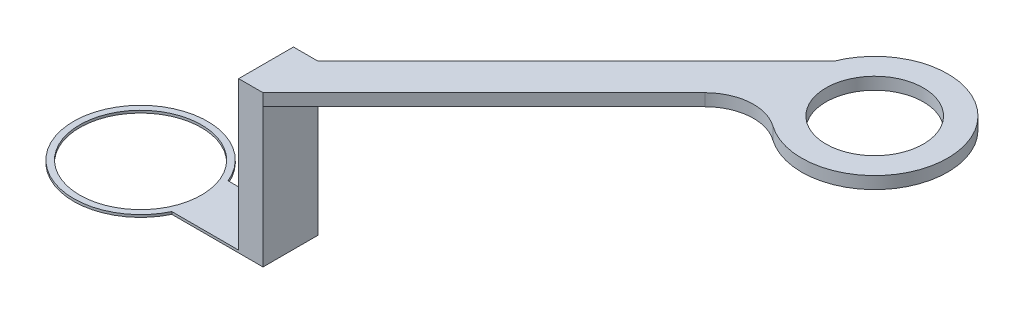
ISO-10303-21;
HEADER;
FILE_DESCRIPTION(('STEP AP214'),'2;1');
FILE_NAME('part.step','',(''),(''),'','','');
FILE_SCHEMA(('AUTOMOTIVE_DESIGN { 1 0 10303 214 1 1 1 1 }'));
ENDSEC;
DATA;
#1=APPLICATION_CONTEXT('core data for automotive mechanical design processes');
#2=APPLICATION_PROTOCOL_DEFINITION('international standard','automotive_design',2000,#1);
#3=PRODUCT_CONTEXT('',#1,'mechanical');
#4=PRODUCT('Part','Part','',(#3));
#5=PRODUCT_RELATED_PRODUCT_CATEGORY('part','',(#4));
#6=PRODUCT_DEFINITION_FORMATION('','',#4);
#7=PRODUCT_DEFINITION_CONTEXT('part definition',#1,'design');
#8=PRODUCT_DEFINITION('design','',#6,#7);
#9=PRODUCT_DEFINITION_SHAPE('','',#8);
#10=(LENGTH_UNIT() NAMED_UNIT(*) SI_UNIT(.MILLI.,.METRE.));
#11=(NAMED_UNIT(*) PLANE_ANGLE_UNIT() SI_UNIT($,.RADIAN.));
#12=(NAMED_UNIT(*) SI_UNIT($,.STERADIAN.) SOLID_ANGLE_UNIT());
#13=UNCERTAINTY_MEASURE_WITH_UNIT(LENGTH_MEASURE(1.E-05),#10,'distance_accuracy_value','');
#14=(GEOMETRIC_REPRESENTATION_CONTEXT(3) GLOBAL_UNCERTAINTY_ASSIGNED_CONTEXT((#13)) GLOBAL_UNIT_ASSIGNED_CONTEXT((#10,
#11,#12)) REPRESENTATION_CONTEXT('',''));
#15=CARTESIAN_POINT('',(0.,0.,0.));
#16=DIRECTION('',(0.,0.,1.));
#17=DIRECTION('',(1.,0.,0.));
#18=AXIS2_PLACEMENT_3D('',#15,#16,#17);
#19=CARTESIAN_POINT('',(12.443307855111,0.2,-2.11234551071727));
#20=DIRECTION('',(-1.,0.,0.));
#21=DIRECTION('',(0.,0.,1.));
#22=AXIS2_PLACEMENT_3D('',#19,#20,#21);
#23=PLANE('',#22);
#24=DIRECTION('',(0.,0.,-1.));
#25=VECTOR('',#24,1.);
#26=CARTESIAN_POINT('',(12.443307855111,11.4,2.38765448928273));
#27=LINE('',#26,#25);
#28=CARTESIAN_POINT('',(12.443307855111,11.4,2.38765448928273));
#29=VERTEX_POINT('',#28);
#30=CARTESIAN_POINT('',(12.443307855111,11.4,-2.11234551071727));
#31=VERTEX_POINT('',#30);
#32=EDGE_CURVE('E119',#29,#31,#27,.T.);
#33=ORIENTED_EDGE('',*,*,#32,.F.);
#34=DIRECTION('',(0.,-1.,0.));
#35=VECTOR('',#34,1.);
#36=CARTESIAN_POINT('',(12.443307855111,0.2,2.38765448928273));
#37=LINE('',#36,#35);
#38=CARTESIAN_POINT('',(12.443307855111,0.,2.38765448928273));
#39=VERTEX_POINT('',#38);
#40=EDGE_CURVE('E166',#29,#39,#37,.T.);
#41=ORIENTED_EDGE('',*,*,#40,.T.);
#42=DIRECTION('',(0.,0.,-1.));
#43=VECTOR('',#42,1.);
#44=CARTESIAN_POINT('',(12.443307855111,0.,-2.11234551071727));
#45=LINE('',#44,#43);
#46=CARTESIAN_POINT('',(12.443307855111,0.,-2.11234551071727));
#47=VERTEX_POINT('',#46);
#48=EDGE_CURVE('E187',#39,#47,#45,.T.);
#49=ORIENTED_EDGE('',*,*,#48,.T.);
#50=DIRECTION('',(0.,-1.,0.));
#51=VECTOR('',#50,1.);
#52=CARTESIAN_POINT('',(12.443307855111,0.2,-2.11234551071727));
#53=LINE('',#52,#51);
#54=EDGE_CURVE('E194',#31,#47,#53,.T.);
#55=ORIENTED_EDGE('',*,*,#54,.F.);
#56=EDGE_LOOP('',(#33,#41,#49,#55));
#57=FACE_BOUND('',#56,.T.);
#58=ADVANCED_FACE('F32',(#57),#23,.F.);
#59=CARTESIAN_POINT('',(0.,0.2,0.));
#60=DIRECTION('',(0.,1.,0.));
#61=DIRECTION('',(0.,0.,1.));
#62=AXIS2_PLACEMENT_3D('',#59,#60,#61);
#63=PLANE('',#62);
#64=DIRECTION('',(0.,0.,1.));
#65=VECTOR('',#64,1.);
#66=CARTESIAN_POINT('',(10.443307855111,0.2,-2.11234551071727));
#67=LINE('',#66,#65);
#68=CARTESIAN_POINT('',(10.443307855111,0.2,-2.11234551071727));
#69=VERTEX_POINT('',#68);
#70=CARTESIAN_POINT('',(10.443307855111,0.2,2.38765448928273));
#71=VERTEX_POINT('',#70);
#72=EDGE_CURVE('E157',#69,#71,#67,.T.);
#73=ORIENTED_EDGE('',*,*,#72,.F.);
#74=DIRECTION('',(-1.,0.,0.));
#75=VECTOR('',#74,1.);
#76=CARTESIAN_POINT('',(5.07818830325861,0.2,-2.11234551071727));
#77=LINE('',#76,#75);
#78=CARTESIAN_POINT('',(5.07818830325861,0.2,-2.11234551071727));
#79=VERTEX_POINT('',#78);
#80=EDGE_CURVE('E173',#69,#79,#77,.T.);
#81=ORIENTED_EDGE('',*,*,#80,.T.);
#82=CARTESIAN_POINT('',(0.,0.2,0.));
#83=DIRECTION('',(0.,1.,0.));
#84=DIRECTION('',(0.,0.,1.));
#85=AXIS2_PLACEMENT_3D('',#82,#83,#84);
#86=CIRCLE('',#85,5.5);
#87=CARTESIAN_POINT('',(4.95470544430323,0.2,2.38765448928273));
#88=VERTEX_POINT('',#87);
#89=EDGE_CURVE('E174',#79,#88,#86,.T.);
#90=ORIENTED_EDGE('',*,*,#89,.T.);
#91=DIRECTION('',(1.,0.,0.));
#92=VECTOR('',#91,1.);
#93=CARTESIAN_POINT('',(12.443307855111,0.2,2.38765448928273));
#94=LINE('',#93,#92);
#95=EDGE_CURVE('E170',#88,#71,#94,.T.);
#96=ORIENTED_EDGE('',*,*,#95,.T.);
#97=EDGE_LOOP('',(#73,#81,#90,#96));
#98=FACE_BOUND('',#97,.T.);
#99=CARTESIAN_POINT('',(0.,0.2,0.));
#100=DIRECTION('',(0.,1.,0.));
#101=DIRECTION('',(0.,0.,1.));
#102=AXIS2_PLACEMENT_3D('',#99,#100,#101);
#103=CIRCLE('',#102,5.);
#104=CARTESIAN_POINT('',(0.,0.2,5.));
#105=VERTEX_POINT('',#104);
#106=EDGE_CURVE('E185',#105,#105,#103,.T.);
#107=ORIENTED_EDGE('',*,*,#106,.F.);
#108=EDGE_LOOP('',(#107));
#109=FACE_BOUND('',#108,.T.);
#110=ADVANCED_FACE('F221',(#98,#109),#63,.T.);
#111=CARTESIAN_POINT('',(0.,0.,0.));
#112=DIRECTION('',(0.,1.,0.));
#113=DIRECTION('',(0.,0.,1.));
#114=AXIS2_PLACEMENT_3D('',#111,#112,#113);
#115=PLANE('',#114);
#116=CARTESIAN_POINT('',(0.,0.,0.));
#117=DIRECTION('',(0.,1.,0.));
#118=DIRECTION('',(0.,0.,1.));
#119=AXIS2_PLACEMENT_3D('',#116,#117,#118);
#120=CIRCLE('',#119,5.5);
#121=CARTESIAN_POINT('',(5.07818830325861,0.,-2.11234551071727));
#122=VERTEX_POINT('',#121);
#123=CARTESIAN_POINT('',(4.95470544430323,0.,2.38765448928273));
#124=VERTEX_POINT('',#123);
#125=EDGE_CURVE('E182',#122,#124,#120,.T.);
#126=ORIENTED_EDGE('',*,*,#125,.F.);
#127=DIRECTION('',(-1.,0.,0.));
#128=VECTOR('',#127,1.);
#129=CARTESIAN_POINT('',(5.07818830325861,0.,-2.11234551071727));
#130=LINE('',#129,#128);
#131=EDGE_CURVE('E190',#47,#122,#130,.T.);
#132=ORIENTED_EDGE('',*,*,#131,.F.);
#133=ORIENTED_EDGE('',*,*,#48,.F.);
#134=DIRECTION('',(1.,0.,0.));
#135=VECTOR('',#134,1.);
#136=CARTESIAN_POINT('',(12.443307855111,0.,2.38765448928273));
#137=LINE('',#136,#135);
#138=EDGE_CURVE('E184',#124,#39,#137,.T.);
#139=ORIENTED_EDGE('',*,*,#138,.F.);
#140=EDGE_LOOP('',(#126,#132,#133,#139));
#141=FACE_BOUND('',#140,.T.);
#142=CARTESIAN_POINT('',(0.,0.,0.));
#143=DIRECTION('',(0.,1.,0.));
#144=DIRECTION('',(0.,0.,1.));
#145=AXIS2_PLACEMENT_3D('',#142,#143,#144);
#146=CIRCLE('',#145,5.);
#147=CARTESIAN_POINT('',(0.,0.,5.));
#148=VERTEX_POINT('',#147);
#149=EDGE_CURVE('E233',#148,#148,#146,.T.);
#150=ORIENTED_EDGE('',*,*,#149,.T.);
#151=EDGE_LOOP('',(#150));
#152=FACE_BOUND('',#151,.T.);
#153=ADVANCED_FACE('F210',(#141,#152),#115,.F.);
#154=CARTESIAN_POINT('',(0.,0.2,0.));
#155=DIRECTION('',(0.,-1.,0.));
#156=DIRECTION('',(0.,0.,-1.));
#157=AXIS2_PLACEMENT_3D('',#154,#155,#156);
#158=CYLINDRICAL_SURFACE('',#157,5.5);
#159=ORIENTED_EDGE('',*,*,#125,.T.);
#160=DIRECTION('',(0.,-1.,0.));
#161=VECTOR('',#160,1.);
#162=CARTESIAN_POINT('',(4.95470544430323,0.2,2.38765448928273));
#163=LINE('',#162,#161);
#164=EDGE_CURVE('E158',#88,#124,#163,.T.);
#165=ORIENTED_EDGE('',*,*,#164,.F.);
#166=ORIENTED_EDGE('',*,*,#89,.F.);
#167=DIRECTION('',(0.,-1.,0.));
#168=VECTOR('',#167,1.);
#169=CARTESIAN_POINT('',(5.07818830325861,0.2,-2.11234551071727));
#170=LINE('',#169,#168);
#171=EDGE_CURVE('E192',#79,#122,#170,.T.);
#172=ORIENTED_EDGE('',*,*,#171,.T.);
#173=EDGE_LOOP('',(#159,#165,#166,#172));
#174=FACE_BOUND('',#173,.T.);
#175=ADVANCED_FACE('F218',(#174),#158,.T.);
#176=CARTESIAN_POINT('',(12.443307855111,0.2,2.38765448928273));
#177=DIRECTION('',(0.,0.,-1.));
#178=DIRECTION('',(-1.,0.,0.));
#179=AXIS2_PLACEMENT_3D('',#176,#177,#178);
#180=PLANE('',#179);
#181=ORIENTED_EDGE('',*,*,#138,.T.);
#182=ORIENTED_EDGE('',*,*,#40,.F.);
#183=CARTESIAN_POINT('',(12.443307855111,12.4,2.38765448928273));
#184=VERTEX_POINT('',#183);
#185=EDGE_CURVE('E147',#184,#29,#37,.T.);
#186=ORIENTED_EDGE('',*,*,#185,.F.);
#187=DIRECTION('',(1.,0.,0.));
#188=VECTOR('',#187,1.);
#189=CARTESIAN_POINT('',(12.443307855111,12.4,2.38765448928273));
#190=LINE('',#189,#188);
#191=CARTESIAN_POINT('',(10.443307855111,12.4,2.38765448928273));
#192=VERTEX_POINT('',#191);
#193=EDGE_CURVE('E237',#192,#184,#190,.T.);
#194=ORIENTED_EDGE('',*,*,#193,.F.);
#195=DIRECTION('',(0.,-1.,0.));
#196=VECTOR('',#195,1.);
#197=CARTESIAN_POINT('',(10.443307855111,12.4,2.38765448928273));
#198=LINE('',#197,#196);
#199=EDGE_CURVE('E234',#192,#71,#198,.T.);
#200=ORIENTED_EDGE('',*,*,#199,.T.);
#201=ORIENTED_EDGE('',*,*,#95,.F.);
#202=ORIENTED_EDGE('',*,*,#164,.T.);
#203=EDGE_LOOP('',(#181,#182,#186,#194,#200,#201,#202));
#204=FACE_BOUND('',#203,.T.);
#205=ADVANCED_FACE('F207',(#204),#180,.F.);
#206=CARTESIAN_POINT('',(5.07818830325861,0.2,-2.11234551071727));
#207=DIRECTION('',(0.,0.,1.));
#208=DIRECTION('',(1.,0.,0.));
#209=AXIS2_PLACEMENT_3D('',#206,#207,#208);
#210=PLANE('',#209);
#211=ORIENTED_EDGE('',*,*,#131,.T.);
#212=ORIENTED_EDGE('',*,*,#171,.F.);
#213=ORIENTED_EDGE('',*,*,#80,.F.);
#214=DIRECTION('',(0.,-1.,0.));
#215=VECTOR('',#214,1.);
#216=CARTESIAN_POINT('',(10.443307855111,12.4,-2.11234551071727));
#217=LINE('',#216,#215);
#218=CARTESIAN_POINT('',(10.443307855111,12.4,-2.11234551071727));
#219=VERTEX_POINT('',#218);
#220=EDGE_CURVE('E226',#219,#69,#217,.T.);
#221=ORIENTED_EDGE('',*,*,#220,.F.);
#222=DIRECTION('',(-1.,0.,0.));
#223=VECTOR('',#222,1.);
#224=CARTESIAN_POINT('',(12.443307855111,12.4,-2.11234551071727));
#225=LINE('',#224,#223);
#226=CARTESIAN_POINT('',(12.443307855111,12.4,-2.11234551071727));
#227=VERTEX_POINT('',#226);
#228=EDGE_CURVE('E243',#227,#219,#225,.T.);
#229=ORIENTED_EDGE('',*,*,#228,.F.);
#230=EDGE_CURVE('E200',#227,#31,#53,.T.);
#231=ORIENTED_EDGE('',*,*,#230,.T.);
#232=ORIENTED_EDGE('',*,*,#54,.T.);
#233=EDGE_LOOP('',(#211,#212,#213,#221,#229,#231,#232));
#234=FACE_BOUND('',#233,.T.);
#235=ADVANCED_FACE('F214',(#234),#210,.F.);
#236=CARTESIAN_POINT('',(0.,0.2,0.));
#237=DIRECTION('',(0.,-1.,0.));
#238=DIRECTION('',(0.,0.,-1.));
#239=AXIS2_PLACEMENT_3D('',#236,#237,#238);
#240=CYLINDRICAL_SURFACE('',#239,5.);
#241=ORIENTED_EDGE('',*,*,#106,.T.);
#242=EDGE_LOOP('',(#241));
#243=FACE_BOUND('',#242,.T.);
#244=ORIENTED_EDGE('',*,*,#149,.F.);
#245=EDGE_LOOP('',(#244));
#246=FACE_BOUND('',#245,.T.);
#247=ADVANCED_FACE('F251',(#243,#246),#240,.F.);
#248=CARTESIAN_POINT('',(10.443307855111,12.4,-2.11234551071727));
#249=DIRECTION('',(1.,0.,0.));
#250=DIRECTION('',(0.,0.,-1.));
#251=AXIS2_PLACEMENT_3D('',#248,#249,#250);
#252=PLANE('',#251);
#253=ORIENTED_EDGE('',*,*,#72,.T.);
#254=ORIENTED_EDGE('',*,*,#199,.F.);
#255=DIRECTION('',(0.,0.,1.));
#256=VECTOR('',#255,1.);
#257=CARTESIAN_POINT('',(10.443307855111,12.4,-2.11234551071727));
#258=LINE('',#257,#256);
#259=EDGE_CURVE('E232',#219,#192,#258,.T.);
#260=ORIENTED_EDGE('',*,*,#259,.F.);
#261=ORIENTED_EDGE('',*,*,#220,.T.);
#262=EDGE_LOOP('',(#253,#254,#260,#261));
#263=FACE_BOUND('',#262,.T.);
#264=ADVANCED_FACE('F229',(#263),#252,.F.);
#265=CARTESIAN_POINT('',(0.,12.4,0.));
#266=DIRECTION('',(0.,-1.,0.));
#267=DIRECTION('',(0.,0.,-1.));
#268=AXIS2_PLACEMENT_3D('',#265,#266,#267);
#269=PLANE('',#268);
#270=ORIENTED_EDGE('',*,*,#193,.T.);
#271=DIRECTION('',(-0.707106781186546,0.,0.707106781186549));
#272=VECTOR('',#271,1.);
#273=CARTESIAN_POINT('',(33.6565112907073,12.4,-18.8255489463137));
#274=LINE('',#273,#272);
#275=CARTESIAN_POINT('',(30.5893806378025,12.4,-15.7584182934088));
#276=VERTEX_POINT('',#275);
#277=EDGE_CURVE('E118',#276,#184,#274,.T.);
#278=ORIENTED_EDGE('',*,*,#277,.F.);
#279=CARTESIAN_POINT('',(33.4178077625486,12.4,-12.9299911686627));
#280=DIRECTION('',(0.,-1.,0.));
#281=DIRECTION('',(0.,0.,-1.));
#282=AXIS2_PLACEMENT_3D('',#279,#280,#281);
#283=CIRCLE('',#282,4.);
#284=CARTESIAN_POINT('',(35.7381487199408,12.4,-16.1882142797231));
#285=VERTEX_POINT('',#284);
#286=EDGE_CURVE('E11',#276,#285,#283,.T.);
#287=ORIENTED_EDGE('',*,*,#286,.T.);
#288=CARTESIAN_POINT('',(39.2186601560291,12.4,-21.0755489463137));
#289=DIRECTION('',(0.,1.,0.));
#290=DIRECTION('',(0.,0.,1.));
#291=AXIS2_PLACEMENT_3D('',#288,#289,#290);
#292=CIRCLE('',#291,5.99999999999999);
#293=CARTESIAN_POINT('',(33.6565112907073,12.4,-23.3255489463137));
#294=VERTEX_POINT('',#293);
#295=EDGE_CURVE('E133',#285,#294,#292,.T.);
#296=ORIENTED_EDGE('',*,*,#295,.T.);
#297=DIRECTION('',(-0.707106781186546,0.,0.707106781186549));
#298=VECTOR('',#297,1.);
#299=CARTESIAN_POINT('',(33.6565112907073,12.4,-23.3255489463137));
#300=LINE('',#299,#298);
#301=EDGE_CURVE('E114',#294,#227,#300,.T.);
#302=ORIENTED_EDGE('',*,*,#301,.T.);
#303=ORIENTED_EDGE('',*,*,#228,.T.);
#304=ORIENTED_EDGE('',*,*,#259,.T.);
#305=EDGE_LOOP('',(#270,#278,#287,#296,#302,#303,#304));
#306=FACE_BOUND('',#305,.T.);
#307=CARTESIAN_POINT('',(39.2186601560291,12.4,-21.0755489463137));
#308=DIRECTION('',(0.,1.,0.));
#309=DIRECTION('',(0.,0.,1.));
#310=AXIS2_PLACEMENT_3D('',#307,#308,#309);
#311=CIRCLE('',#310,4.00000000000001);
#312=CARTESIAN_POINT('',(39.2186601560291,12.4,-17.0755489463137));
#313=VERTEX_POINT('',#312);
#314=EDGE_CURVE('E137',#313,#313,#311,.T.);
#315=ORIENTED_EDGE('',*,*,#314,.F.);
#316=EDGE_LOOP('',(#315));
#317=FACE_BOUND('',#316,.T.);
#318=ADVANCED_FACE('F293',(#306,#317),#269,.F.);
#319=CARTESIAN_POINT('',(33.6565112907073,12.4,-18.8255489463137));
#320=DIRECTION('',(-0.707106781186549,0.,-0.707106781186546));
#321=DIRECTION('',(-0.707106781186546,0.,0.707106781186549));
#322=AXIS2_PLACEMENT_3D('',#319,#320,#321);
#323=PLANE('',#322);
#324=DIRECTION('',(-0.707106781186546,0.,0.707106781186549));
#325=VECTOR('',#324,1.);
#326=CARTESIAN_POINT('',(33.6565112907073,11.4,-18.8255489463137));
#327=LINE('',#326,#325);
#328=CARTESIAN_POINT('',(30.5893806378025,11.4,-15.7584182934088));
#329=VERTEX_POINT('',#328);
#330=EDGE_CURVE('E126',#329,#29,#327,.T.);
#331=ORIENTED_EDGE('',*,*,#330,.F.);
#332=DIRECTION('',(0.,1.,0.));
#333=VECTOR('',#332,1.);
#334=CARTESIAN_POINT('',(30.5893806378025,12.4,-15.7584182934088));
#335=LINE('',#334,#333);
#336=EDGE_CURVE('E47',#329,#276,#335,.T.);
#337=ORIENTED_EDGE('',*,*,#336,.T.);
#338=ORIENTED_EDGE('',*,*,#277,.T.);
#339=ORIENTED_EDGE('',*,*,#185,.T.);
#340=EDGE_LOOP('',(#331,#337,#338,#339));
#341=FACE_BOUND('',#340,.T.);
#342=ADVANCED_FACE('F299',(#341),#323,.F.);
#343=CARTESIAN_POINT('',(33.6565112907073,11.4,-18.8255489463137));
#344=DIRECTION('',(0.,1.,0.));
#345=DIRECTION('',(0.,0.,1.));
#346=AXIS2_PLACEMENT_3D('',#343,#344,#345);
#347=PLANE('',#346);
#348=ORIENTED_EDGE('',*,*,#32,.T.);
#349=DIRECTION('',(-0.707106781186546,0.,0.707106781186549));
#350=VECTOR('',#349,1.);
#351=CARTESIAN_POINT('',(33.6565112907073,11.4,-23.3255489463137));
#352=LINE('',#351,#350);
#353=CARTESIAN_POINT('',(33.6565112907073,11.4,-23.3255489463137));
#354=VERTEX_POINT('',#353);
#355=EDGE_CURVE('E112',#354,#31,#352,.T.);
#356=ORIENTED_EDGE('',*,*,#355,.F.);
#357=CARTESIAN_POINT('',(39.2186601560291,11.4,-21.0755489463137));
#358=DIRECTION('',(0.,1.,0.));
#359=DIRECTION('',(0.,0.,1.));
#360=AXIS2_PLACEMENT_3D('',#357,#358,#359);
#361=CIRCLE('',#360,5.99999999999999);
#362=CARTESIAN_POINT('',(35.7381487199408,11.4,-16.1882142797231));
#363=VERTEX_POINT('',#362);
#364=EDGE_CURVE('E124',#354,#363,#361,.F.);
#365=ORIENTED_EDGE('',*,*,#364,.T.);
#366=CARTESIAN_POINT('',(33.4178077625486,11.4,-12.9299911686627));
#367=DIRECTION('',(0.,1.,0.));
#368=DIRECTION('',(0.,0.,1.));
#369=AXIS2_PLACEMENT_3D('',#366,#367,#368);
#370=CIRCLE('',#369,4.);
#371=EDGE_CURVE('E40',#363,#329,#370,.T.);
#372=ORIENTED_EDGE('',*,*,#371,.T.);
#373=ORIENTED_EDGE('',*,*,#330,.T.);
#374=EDGE_LOOP('',(#348,#356,#365,#372,#373));
#375=FACE_BOUND('',#374,.T.);
#376=CARTESIAN_POINT('',(39.2186601560291,11.4,-21.0755489463137));
#377=DIRECTION('',(0.,1.,0.));
#378=DIRECTION('',(0.,0.,1.));
#379=AXIS2_PLACEMENT_3D('',#376,#377,#378);
#380=CIRCLE('',#379,4.00000000000001);
#381=CARTESIAN_POINT('',(39.2186601560291,11.4,-17.0755489463137));
#382=VERTEX_POINT('',#381);
#383=EDGE_CURVE('E132',#382,#382,#380,.F.);
#384=ORIENTED_EDGE('',*,*,#383,.F.);
#385=EDGE_LOOP('',(#384));
#386=FACE_BOUND('',#385,.T.);
#387=ADVANCED_FACE('F122',(#375,#386),#347,.F.);
#388=CARTESIAN_POINT('',(33.6565112907073,12.4,-23.3255489463137));
#389=DIRECTION('',(0.707106781186549,0.,0.707106781186546));
#390=DIRECTION('',(0.707106781186546,0.,-0.707106781186549));
#391=AXIS2_PLACEMENT_3D('',#388,#389,#390);
#392=PLANE('',#391);
#393=ORIENTED_EDGE('',*,*,#230,.F.);
#394=ORIENTED_EDGE('',*,*,#301,.F.);
#395=DIRECTION('',(0.,1.,0.));
#396=VECTOR('',#395,1.);
#397=CARTESIAN_POINT('',(33.6565112907073,12.4,-23.3255489463137));
#398=LINE('',#397,#396);
#399=EDGE_CURVE('E108',#354,#294,#398,.T.);
#400=ORIENTED_EDGE('',*,*,#399,.F.);
#401=ORIENTED_EDGE('',*,*,#355,.T.);
#402=EDGE_LOOP('',(#393,#394,#400,#401));
#403=FACE_BOUND('',#402,.T.);
#404=ADVANCED_FACE('F111',(#403),#392,.F.);
#405=CARTESIAN_POINT('',(39.2186601560291,-5.2638316837353,-21.0755489463137));
#406=DIRECTION('',(0.,1.,0.));
#407=DIRECTION('',(0.,0.,1.));
#408=AXIS2_PLACEMENT_3D('',#405,#406,#407);
#409=CYLINDRICAL_SURFACE('',#408,5.99999999999999);
#410=ORIENTED_EDGE('',*,*,#295,.F.);
#411=DIRECTION('',(0.,1.,0.));
#412=VECTOR('',#411,1.);
#413=CARTESIAN_POINT('',(35.7381487199408,-5.2638316837353,-16.1882142797231));
#414=LINE('',#413,#412);
#415=EDGE_CURVE('E131',#285,#363,#414,.F.);
#416=ORIENTED_EDGE('',*,*,#415,.T.);
#417=ORIENTED_EDGE('',*,*,#364,.F.);
#418=ORIENTED_EDGE('',*,*,#399,.T.);
#419=EDGE_LOOP('',(#410,#416,#417,#418));
#420=FACE_BOUND('',#419,.T.);
#421=ADVANCED_FACE('F129',(#420),#409,.T.);
#422=CARTESIAN_POINT('',(39.2186601560291,-5.2638316837353,-21.0755489463137));
#423=DIRECTION('',(0.,1.,0.));
#424=DIRECTION('',(0.,0.,1.));
#425=AXIS2_PLACEMENT_3D('',#422,#423,#424);
#426=CYLINDRICAL_SURFACE('',#425,4.00000000000001);
#427=ORIENTED_EDGE('',*,*,#383,.T.);
#428=EDGE_LOOP('',(#427));
#429=FACE_BOUND('',#428,.T.);
#430=ORIENTED_EDGE('',*,*,#314,.T.);
#431=EDGE_LOOP('',(#430));
#432=FACE_BOUND('',#431,.T.);
#433=ADVANCED_FACE('F325',(#429,#432),#426,.F.);
#434=CARTESIAN_POINT('',(33.4178077625486,-5.2638316837353,-12.9299911686627));
#435=DIRECTION('',(0.,1.,0.));
#436=DIRECTION('',(0.,0.,1.));
#437=AXIS2_PLACEMENT_3D('',#434,#435,#436);
#438=CYLINDRICAL_SURFACE('',#437,4.);
#439=ORIENTED_EDGE('',*,*,#286,.F.);
#440=ORIENTED_EDGE('',*,*,#336,.F.);
#441=ORIENTED_EDGE('',*,*,#371,.F.);
#442=ORIENTED_EDGE('',*,*,#415,.F.);
#443=EDGE_LOOP('',(#439,#440,#441,#442));
#444=FACE_BOUND('',#443,.T.);
#445=ADVANCED_FACE('F34',(#444),#438,.F.);
#446=CLOSED_SHELL('',(#58,#110,#153,#175,#205,#235,#247,#264,#318,#342,#387,#404,#421,#433,#445));
#447=MANIFOLD_SOLID_BREP('B2',#446);
#448=ADVANCED_BREP_SHAPE_REPRESENTATION('',(#18,#447),#14);
#449=SHAPE_DEFINITION_REPRESENTATION(#9,#448);
ENDSEC;
END-ISO-10303-21;
